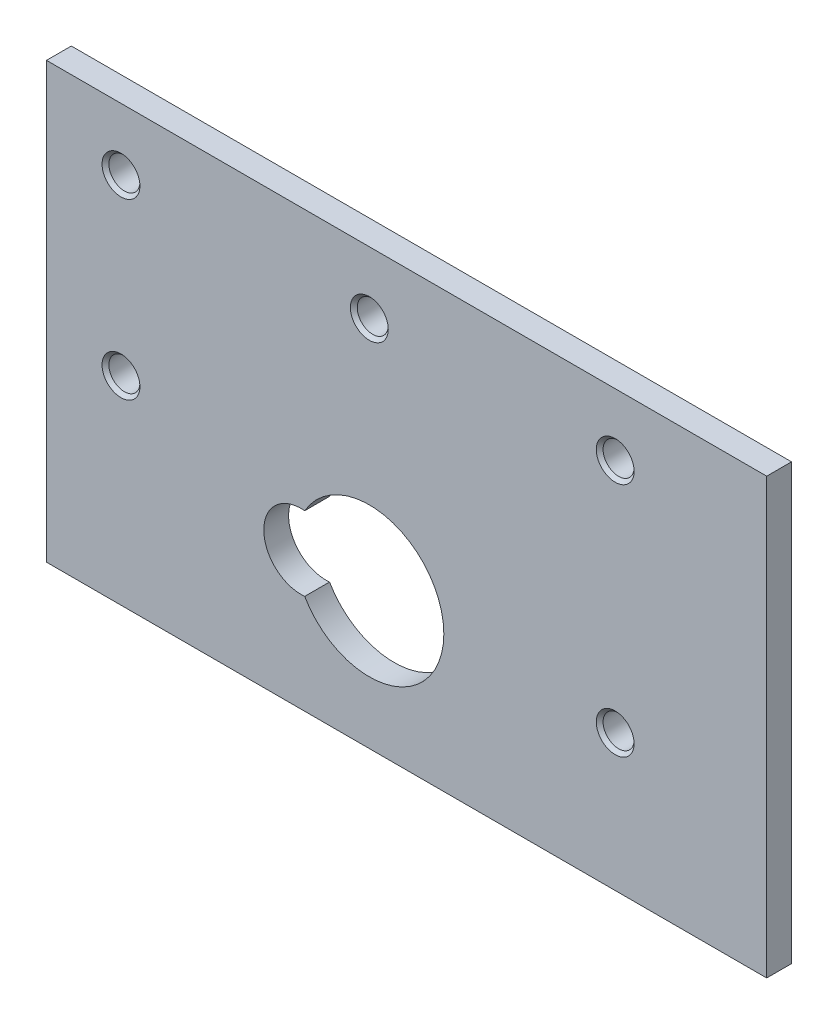
ISO-10303-21;
HEADER;
FILE_DESCRIPTION(('STEP AP214'),'2;1');
FILE_NAME('part.step','',(''),(''),'','','');
FILE_SCHEMA(('AUTOMOTIVE_DESIGN { 1 0 10303 214 1 1 1 1 }'));
ENDSEC;
DATA;
#1=APPLICATION_CONTEXT('core data for automotive mechanical design processes');
#2=APPLICATION_PROTOCOL_DEFINITION('international standard','automotive_design',2000,#1);
#3=PRODUCT_CONTEXT('',#1,'mechanical');
#4=PRODUCT('Part','Part','',(#3));
#5=PRODUCT_RELATED_PRODUCT_CATEGORY('part','',(#4));
#6=PRODUCT_DEFINITION_FORMATION('','',#4);
#7=PRODUCT_DEFINITION_CONTEXT('part definition',#1,'design');
#8=PRODUCT_DEFINITION('design','',#6,#7);
#9=PRODUCT_DEFINITION_SHAPE('','',#8);
#10=(LENGTH_UNIT() NAMED_UNIT(*) SI_UNIT(.MILLI.,.METRE.));
#11=(NAMED_UNIT(*) PLANE_ANGLE_UNIT() SI_UNIT($,.RADIAN.));
#12=(NAMED_UNIT(*) SI_UNIT($,.STERADIAN.) SOLID_ANGLE_UNIT());
#13=UNCERTAINTY_MEASURE_WITH_UNIT(LENGTH_MEASURE(1.E-05),#10,'distance_accuracy_value','');
#14=(GEOMETRIC_REPRESENTATION_CONTEXT(3) GLOBAL_UNCERTAINTY_ASSIGNED_CONTEXT((#13)) GLOBAL_UNIT_ASSIGNED_CONTEXT((#10,
#11,#12)) REPRESENTATION_CONTEXT('',''));
#15=CARTESIAN_POINT('',(0.,0.,0.));
#16=DIRECTION('',(0.,0.,1.));
#17=DIRECTION('',(1.,0.,0.));
#18=AXIS2_PLACEMENT_3D('',#15,#16,#17);
#19=CARTESIAN_POINT('',(29.,17.5,2.));
#20=DIRECTION('',(-1.,0.,0.));
#21=DIRECTION('',(0.,-1.,0.));
#22=AXIS2_PLACEMENT_3D('',#19,#20,#21);
#23=PLANE('',#22);
#24=DIRECTION('',(0.,1.,0.));
#25=VECTOR('',#24,1.);
#26=CARTESIAN_POINT('',(29.,17.5,0.));
#27=LINE('',#26,#25);
#28=CARTESIAN_POINT('',(29.,-17.5,0.));
#29=VERTEX_POINT('',#28);
#30=CARTESIAN_POINT('',(29.,17.5,0.));
#31=VERTEX_POINT('',#30);
#32=EDGE_CURVE('E189',#29,#31,#27,.T.);
#33=ORIENTED_EDGE('',*,*,#32,.T.);
#34=DIRECTION('',(0.,0.,-1.));
#35=VECTOR('',#34,1.);
#36=CARTESIAN_POINT('',(29.,17.5,2.));
#37=LINE('',#36,#35);
#38=CARTESIAN_POINT('',(29.,17.5,2.));
#39=VERTEX_POINT('',#38);
#40=EDGE_CURVE('E11',#39,#31,#37,.T.);
#41=ORIENTED_EDGE('',*,*,#40,.F.);
#42=DIRECTION('',(0.,1.,0.));
#43=VECTOR('',#42,1.);
#44=CARTESIAN_POINT('',(29.,17.5,2.));
#45=LINE('',#44,#43);
#46=CARTESIAN_POINT('',(29.,-17.5,2.));
#47=VERTEX_POINT('',#46);
#48=EDGE_CURVE('E190',#47,#39,#45,.T.);
#49=ORIENTED_EDGE('',*,*,#48,.F.);
#50=DIRECTION('',(0.,0.,-1.));
#51=VECTOR('',#50,1.);
#52=CARTESIAN_POINT('',(29.,-17.5,2.));
#53=LINE('',#52,#51);
#54=EDGE_CURVE('E204',#47,#29,#53,.T.);
#55=ORIENTED_EDGE('',*,*,#54,.T.);
#56=EDGE_LOOP('',(#33,#41,#49,#55));
#57=FACE_BOUND('',#56,.T.);
#58=ADVANCED_FACE('F53',(#57),#23,.F.);
#59=CARTESIAN_POINT('',(-29.,17.5,2.));
#60=DIRECTION('',(0.,-1.,0.));
#61=DIRECTION('',(0.,0.,-1.));
#62=AXIS2_PLACEMENT_3D('',#59,#60,#61);
#63=PLANE('',#62);
#64=DIRECTION('',(-1.,0.,0.));
#65=VECTOR('',#64,1.);
#66=CARTESIAN_POINT('',(-29.,17.5,0.));
#67=LINE('',#66,#65);
#68=CARTESIAN_POINT('',(-29.,17.5,0.));
#69=VERTEX_POINT('',#68);
#70=EDGE_CURVE('E208',#31,#69,#67,.T.);
#71=ORIENTED_EDGE('',*,*,#70,.T.);
#72=DIRECTION('',(0.,0.,-1.));
#73=VECTOR('',#72,1.);
#74=CARTESIAN_POINT('',(-29.,17.5,2.));
#75=LINE('',#74,#73);
#76=CARTESIAN_POINT('',(-29.,17.5,2.));
#77=VERTEX_POINT('',#76);
#78=EDGE_CURVE('E61',#77,#69,#75,.T.);
#79=ORIENTED_EDGE('',*,*,#78,.F.);
#80=DIRECTION('',(-1.,0.,0.));
#81=VECTOR('',#80,1.);
#82=CARTESIAN_POINT('',(-29.,17.5,2.));
#83=LINE('',#82,#81);
#84=EDGE_CURVE('E194',#39,#77,#83,.T.);
#85=ORIENTED_EDGE('',*,*,#84,.F.);
#86=ORIENTED_EDGE('',*,*,#40,.T.);
#87=EDGE_LOOP('',(#71,#79,#85,#86));
#88=FACE_BOUND('',#87,.T.);
#89=ADVANCED_FACE('F243',(#88),#63,.F.);
#90=CARTESIAN_POINT('',(-29.,17.5,2.));
#91=DIRECTION('',(1.,0.,0.));
#92=DIRECTION('',(0.,0.,-1.));
#93=AXIS2_PLACEMENT_3D('',#90,#91,#92);
#94=PLANE('',#93);
#95=DIRECTION('',(0.,-1.,0.));
#96=VECTOR('',#95,1.);
#97=CARTESIAN_POINT('',(-29.,17.5,0.));
#98=LINE('',#97,#96);
#99=CARTESIAN_POINT('',(-29.,-17.5,0.));
#100=VERTEX_POINT('',#99);
#101=EDGE_CURVE('E211',#69,#100,#98,.T.);
#102=ORIENTED_EDGE('',*,*,#101,.T.);
#103=DIRECTION('',(0.,0.,-1.));
#104=VECTOR('',#103,1.);
#105=CARTESIAN_POINT('',(-29.,-17.5,2.));
#106=LINE('',#105,#104);
#107=CARTESIAN_POINT('',(-29.,-17.5,2.));
#108=VERTEX_POINT('',#107);
#109=EDGE_CURVE('E219',#108,#100,#106,.T.);
#110=ORIENTED_EDGE('',*,*,#109,.F.);
#111=DIRECTION('',(0.,-1.,0.));
#112=VECTOR('',#111,1.);
#113=CARTESIAN_POINT('',(-29.,17.5,2.));
#114=LINE('',#113,#112);
#115=EDGE_CURVE('E198',#77,#108,#114,.T.);
#116=ORIENTED_EDGE('',*,*,#115,.F.);
#117=ORIENTED_EDGE('',*,*,#78,.T.);
#118=EDGE_LOOP('',(#102,#110,#116,#117));
#119=FACE_BOUND('',#118,.T.);
#120=ADVANCED_FACE('F228',(#119),#94,.F.);
#121=CARTESIAN_POINT('',(-29.,-17.5,2.));
#122=DIRECTION('',(0.,1.,0.));
#123=DIRECTION('',(0.,0.,1.));
#124=AXIS2_PLACEMENT_3D('',#121,#122,#123);
#125=PLANE('',#124);
#126=DIRECTION('',(1.,0.,0.));
#127=VECTOR('',#126,1.);
#128=CARTESIAN_POINT('',(-29.,-17.5,0.));
#129=LINE('',#128,#127);
#130=EDGE_CURVE('E195',#100,#29,#129,.T.);
#131=ORIENTED_EDGE('',*,*,#130,.T.);
#132=ORIENTED_EDGE('',*,*,#54,.F.);
#133=DIRECTION('',(1.,0.,0.));
#134=VECTOR('',#133,1.);
#135=CARTESIAN_POINT('',(-29.,-17.5,2.));
#136=LINE('',#135,#134);
#137=EDGE_CURVE('E201',#108,#47,#136,.T.);
#138=ORIENTED_EDGE('',*,*,#137,.F.);
#139=ORIENTED_EDGE('',*,*,#109,.T.);
#140=EDGE_LOOP('',(#131,#132,#138,#139));
#141=FACE_BOUND('',#140,.T.);
#142=ADVANCED_FACE('F236',(#141),#125,.F.);
#143=CARTESIAN_POINT('',(0.,0.,2.));
#144=DIRECTION('',(0.,0.,1.));
#145=DIRECTION('',(1.,0.,0.));
#146=AXIS2_PLACEMENT_3D('',#143,#144,#145);
#147=PLANE('',#146);
#148=CARTESIAN_POINT('',(-3.00000000000001,-6.50000000000001,2.));
#149=DIRECTION('',(0.,0.,1.));
#150=DIRECTION('',(1.,0.,0.));
#151=AXIS2_PLACEMENT_3D('',#148,#149,#150);
#152=CIRCLE('',#151,6.);
#153=CARTESIAN_POINT('',(-8.20454545454547,-9.48541565139099,2.));
#154=VERTEX_POINT('',#153);
#155=CARTESIAN_POINT('',(-8.20454545454547,-3.51458434860902,2.));
#156=VERTEX_POINT('',#155);
#157=EDGE_CURVE('E68',#154,#156,#152,.T.);
#158=ORIENTED_EDGE('',*,*,#157,.F.);
#159=CARTESIAN_POINT('',(-8.50000000000001,-6.50000000000001,2.));
#160=DIRECTION('',(0.,0.,1.));
#161=DIRECTION('',(1.,0.,0.));
#162=AXIS2_PLACEMENT_3D('',#159,#160,#161);
#163=CIRCLE('',#162,3.);
#164=EDGE_CURVE('E120',#156,#154,#163,.T.);
#165=ORIENTED_EDGE('',*,*,#164,.F.);
#166=EDGE_LOOP('',(#158,#165));
#167=FACE_BOUND('',#166,.T.);
#168=CARTESIAN_POINT('',(-23.,12.5,2.));
#169=DIRECTION('',(0.,0.,1.));
#170=DIRECTION('',(1.,0.,0.));
#171=AXIS2_PLACEMENT_3D('',#168,#169,#170);
#172=CIRCLE('',#171,1.525);
#173=CARTESIAN_POINT('',(-21.475,12.5,2.));
#174=VERTEX_POINT('',#173);
#175=EDGE_CURVE('E128',#174,#174,#172,.T.);
#176=ORIENTED_EDGE('',*,*,#175,.F.);
#177=EDGE_LOOP('',(#176));
#178=FACE_BOUND('',#177,.T.);
#179=CARTESIAN_POINT('',(-3.,12.5,2.));
#180=DIRECTION('',(0.,0.,1.));
#181=DIRECTION('',(1.,0.,0.));
#182=AXIS2_PLACEMENT_3D('',#179,#180,#181);
#183=CIRCLE('',#182,1.525);
#184=CARTESIAN_POINT('',(-1.475,12.5,2.));
#185=VERTEX_POINT('',#184);
#186=EDGE_CURVE('E141',#185,#185,#183,.T.);
#187=ORIENTED_EDGE('',*,*,#186,.F.);
#188=EDGE_LOOP('',(#187));
#189=FACE_BOUND('',#188,.T.);
#190=CARTESIAN_POINT('',(16.8,12.5,2.));
#191=DIRECTION('',(0.,0.,1.));
#192=DIRECTION('',(1.,0.,0.));
#193=AXIS2_PLACEMENT_3D('',#190,#191,#192);
#194=CIRCLE('',#193,1.525);
#195=CARTESIAN_POINT('',(18.325,12.5,2.));
#196=VERTEX_POINT('',#195);
#197=EDGE_CURVE('E153',#196,#196,#194,.T.);
#198=ORIENTED_EDGE('',*,*,#197,.F.);
#199=EDGE_LOOP('',(#198));
#200=FACE_BOUND('',#199,.T.);
#201=CARTESIAN_POINT('',(16.8,-6.50000000000001,2.));
#202=DIRECTION('',(0.,0.,1.));
#203=DIRECTION('',(1.,0.,0.));
#204=AXIS2_PLACEMENT_3D('',#201,#202,#203);
#205=CIRCLE('',#204,1.525);
#206=CARTESIAN_POINT('',(18.325,-6.50000000000001,2.));
#207=VERTEX_POINT('',#206);
#208=EDGE_CURVE('E165',#207,#207,#205,.T.);
#209=ORIENTED_EDGE('',*,*,#208,.F.);
#210=EDGE_LOOP('',(#209));
#211=FACE_BOUND('',#210,.T.);
#212=CARTESIAN_POINT('',(-23.,-1.5,2.));
#213=DIRECTION('',(0.,0.,1.));
#214=DIRECTION('',(1.,0.,0.));
#215=AXIS2_PLACEMENT_3D('',#212,#213,#214);
#216=CIRCLE('',#215,1.525);
#217=CARTESIAN_POINT('',(-21.475,-1.5,2.));
#218=VERTEX_POINT('',#217);
#219=EDGE_CURVE('E177',#218,#218,#216,.T.);
#220=ORIENTED_EDGE('',*,*,#219,.F.);
#221=EDGE_LOOP('',(#220));
#222=FACE_BOUND('',#221,.T.);
#223=ORIENTED_EDGE('',*,*,#48,.T.);
#224=ORIENTED_EDGE('',*,*,#84,.T.);
#225=ORIENTED_EDGE('',*,*,#115,.T.);
#226=ORIENTED_EDGE('',*,*,#137,.T.);
#227=EDGE_LOOP('',(#223,#224,#225,#226));
#228=FACE_BOUND('',#227,.T.);
#229=ADVANCED_FACE('F242',(#167,#178,#189,#200,#211,#222,#228),#147,.T.);
#230=CARTESIAN_POINT('',(0.,0.,0.));
#231=DIRECTION('',(0.,0.,1.));
#232=DIRECTION('',(1.,0.,0.));
#233=AXIS2_PLACEMENT_3D('',#230,#231,#232);
#234=PLANE('',#233);
#235=CARTESIAN_POINT('',(-8.50000000000001,-6.50000000000001,0.));
#236=DIRECTION('',(0.,0.,1.));
#237=DIRECTION('',(1.,0.,0.));
#238=AXIS2_PLACEMENT_3D('',#235,#236,#237);
#239=CIRCLE('',#238,3.);
#240=CARTESIAN_POINT('',(-8.20454545454547,-3.51458434860902,0.));
#241=VERTEX_POINT('',#240);
#242=CARTESIAN_POINT('',(-8.20454545454547,-9.48541565139099,0.));
#243=VERTEX_POINT('',#242);
#244=EDGE_CURVE('E110',#241,#243,#239,.T.);
#245=ORIENTED_EDGE('',*,*,#244,.T.);
#246=CARTESIAN_POINT('',(-3.00000000000001,-6.50000000000001,0.));
#247=DIRECTION('',(0.,0.,1.));
#248=DIRECTION('',(1.,0.,0.));
#249=AXIS2_PLACEMENT_3D('',#246,#247,#248);
#250=CIRCLE('',#249,6.);
#251=EDGE_CURVE('E73',#243,#241,#250,.T.);
#252=ORIENTED_EDGE('',*,*,#251,.T.);
#253=EDGE_LOOP('',(#245,#252));
#254=FACE_BOUND('',#253,.T.);
#255=CARTESIAN_POINT('',(-23.,12.5,0.));
#256=DIRECTION('',(0.,0.,1.));
#257=DIRECTION('',(1.,0.,0.));
#258=AXIS2_PLACEMENT_3D('',#255,#256,#257);
#259=CIRCLE('',#258,1.25);
#260=CARTESIAN_POINT('',(-21.75,12.5,0.));
#261=VERTEX_POINT('',#260);
#262=EDGE_CURVE('E137',#261,#261,#259,.T.);
#263=ORIENTED_EDGE('',*,*,#262,.T.);
#264=EDGE_LOOP('',(#263));
#265=FACE_BOUND('',#264,.T.);
#266=CARTESIAN_POINT('',(-3.,12.5,0.));
#267=DIRECTION('',(0.,0.,1.));
#268=DIRECTION('',(1.,0.,0.));
#269=AXIS2_PLACEMENT_3D('',#266,#267,#268);
#270=CIRCLE('',#269,1.25);
#271=CARTESIAN_POINT('',(-1.75,12.5,0.));
#272=VERTEX_POINT('',#271);
#273=EDGE_CURVE('E149',#272,#272,#270,.T.);
#274=ORIENTED_EDGE('',*,*,#273,.T.);
#275=EDGE_LOOP('',(#274));
#276=FACE_BOUND('',#275,.T.);
#277=CARTESIAN_POINT('',(16.8,12.5,0.));
#278=DIRECTION('',(0.,0.,1.));
#279=DIRECTION('',(1.,0.,0.));
#280=AXIS2_PLACEMENT_3D('',#277,#278,#279);
#281=CIRCLE('',#280,1.25);
#282=CARTESIAN_POINT('',(18.05,12.5,0.));
#283=VERTEX_POINT('',#282);
#284=EDGE_CURVE('E161',#283,#283,#281,.T.);
#285=ORIENTED_EDGE('',*,*,#284,.T.);
#286=EDGE_LOOP('',(#285));
#287=FACE_BOUND('',#286,.T.);
#288=CARTESIAN_POINT('',(16.8,-6.50000000000001,0.));
#289=DIRECTION('',(0.,0.,1.));
#290=DIRECTION('',(1.,0.,0.));
#291=AXIS2_PLACEMENT_3D('',#288,#289,#290);
#292=CIRCLE('',#291,1.25);
#293=CARTESIAN_POINT('',(18.05,-6.50000000000001,0.));
#294=VERTEX_POINT('',#293);
#295=EDGE_CURVE('E173',#294,#294,#292,.T.);
#296=ORIENTED_EDGE('',*,*,#295,.T.);
#297=EDGE_LOOP('',(#296));
#298=FACE_BOUND('',#297,.T.);
#299=CARTESIAN_POINT('',(-23.,-1.5,0.));
#300=DIRECTION('',(0.,0.,1.));
#301=DIRECTION('',(1.,0.,0.));
#302=AXIS2_PLACEMENT_3D('',#299,#300,#301);
#303=CIRCLE('',#302,1.25);
#304=CARTESIAN_POINT('',(-21.75,-1.5,0.));
#305=VERTEX_POINT('',#304);
#306=EDGE_CURVE('E185',#305,#305,#303,.T.);
#307=ORIENTED_EDGE('',*,*,#306,.T.);
#308=EDGE_LOOP('',(#307));
#309=FACE_BOUND('',#308,.T.);
#310=ORIENTED_EDGE('',*,*,#32,.F.);
#311=ORIENTED_EDGE('',*,*,#130,.F.);
#312=ORIENTED_EDGE('',*,*,#101,.F.);
#313=ORIENTED_EDGE('',*,*,#70,.F.);
#314=EDGE_LOOP('',(#310,#311,#312,#313));
#315=FACE_BOUND('',#314,.T.);
#316=ADVANCED_FACE('F117',(#254,#265,#276,#287,#298,#309,#315),#234,.F.);
#317=CARTESIAN_POINT('',(-23.,-1.5,2.));
#318=DIRECTION('',(0.,0.,1.));
#319=DIRECTION('',(1.,0.,0.));
#320=AXIS2_PLACEMENT_3D('',#317,#318,#319);
#321=CYLINDRICAL_SURFACE('',#320,1.24999999999999);
#322=ORIENTED_EDGE('',*,*,#306,.F.);
#323=EDGE_LOOP('',(#322));
#324=FACE_BOUND('',#323,.T.);
#325=CARTESIAN_POINT('',(-23.,-1.5,1.72499999999999));
#326=DIRECTION('',(0.,0.,1.));
#327=DIRECTION('',(1.,0.,0.));
#328=AXIS2_PLACEMENT_3D('',#325,#326,#327);
#329=CIRCLE('',#328,1.24999999999999);
#330=CARTESIAN_POINT('',(-21.75,-1.5,1.72499999999999));
#331=VERTEX_POINT('',#330);
#332=EDGE_CURVE('E181',#331,#331,#329,.T.);
#333=ORIENTED_EDGE('',*,*,#332,.T.);
#334=EDGE_LOOP('',(#333));
#335=FACE_BOUND('',#334,.T.);
#336=ADVANCED_FACE('F255',(#324,#335),#321,.F.);
#337=CARTESIAN_POINT('',(-23.,-1.5,2.));
#338=DIRECTION('',(0.,0.,1.));
#339=DIRECTION('',(1.,0.,0.));
#340=AXIS2_PLACEMENT_3D('',#337,#338,#339);
#341=CONICAL_SURFACE('',#340,1.525,0.785398163397451);
#342=ORIENTED_EDGE('',*,*,#332,.F.);
#343=EDGE_LOOP('',(#342));
#344=FACE_BOUND('',#343,.T.);
#345=ORIENTED_EDGE('',*,*,#219,.T.);
#346=EDGE_LOOP('',(#345));
#347=FACE_BOUND('',#346,.T.);
#348=ADVANCED_FACE('F261',(#344,#347),#341,.F.);
#349=CARTESIAN_POINT('',(16.8,-6.50000000000001,2.));
#350=DIRECTION('',(0.,0.,1.));
#351=DIRECTION('',(1.,0.,0.));
#352=AXIS2_PLACEMENT_3D('',#349,#350,#351);
#353=CYLINDRICAL_SURFACE('',#352,1.24999999999999);
#354=ORIENTED_EDGE('',*,*,#295,.F.);
#355=EDGE_LOOP('',(#354));
#356=FACE_BOUND('',#355,.T.);
#357=CARTESIAN_POINT('',(16.8,-6.50000000000001,1.72499999999999));
#358=DIRECTION('',(0.,0.,1.));
#359=DIRECTION('',(1.,0.,0.));
#360=AXIS2_PLACEMENT_3D('',#357,#358,#359);
#361=CIRCLE('',#360,1.24999999999999);
#362=CARTESIAN_POINT('',(18.05,-6.50000000000001,1.72499999999999));
#363=VERTEX_POINT('',#362);
#364=EDGE_CURVE('E169',#363,#363,#361,.T.);
#365=ORIENTED_EDGE('',*,*,#364,.T.);
#366=EDGE_LOOP('',(#365));
#367=FACE_BOUND('',#366,.T.);
#368=ADVANCED_FACE('F265',(#356,#367),#353,.F.);
#369=CARTESIAN_POINT('',(16.8,-6.50000000000001,2.));
#370=DIRECTION('',(0.,0.,1.));
#371=DIRECTION('',(1.,0.,0.));
#372=AXIS2_PLACEMENT_3D('',#369,#370,#371);
#373=CONICAL_SURFACE('',#372,1.525,0.785398163397451);
#374=ORIENTED_EDGE('',*,*,#364,.F.);
#375=EDGE_LOOP('',(#374));
#376=FACE_BOUND('',#375,.T.);
#377=ORIENTED_EDGE('',*,*,#208,.T.);
#378=EDGE_LOOP('',(#377));
#379=FACE_BOUND('',#378,.T.);
#380=ADVANCED_FACE('F269',(#376,#379),#373,.F.);
#381=CARTESIAN_POINT('',(16.8,12.5,2.));
#382=DIRECTION('',(0.,0.,1.));
#383=DIRECTION('',(1.,0.,0.));
#384=AXIS2_PLACEMENT_3D('',#381,#382,#383);
#385=CYLINDRICAL_SURFACE('',#384,1.24999999999999);
#386=ORIENTED_EDGE('',*,*,#284,.F.);
#387=EDGE_LOOP('',(#386));
#388=FACE_BOUND('',#387,.T.);
#389=CARTESIAN_POINT('',(16.8,12.5,1.72499999999999));
#390=DIRECTION('',(0.,0.,1.));
#391=DIRECTION('',(1.,0.,0.));
#392=AXIS2_PLACEMENT_3D('',#389,#390,#391);
#393=CIRCLE('',#392,1.24999999999999);
#394=CARTESIAN_POINT('',(18.05,12.5,1.72499999999999));
#395=VERTEX_POINT('',#394);
#396=EDGE_CURVE('E157',#395,#395,#393,.T.);
#397=ORIENTED_EDGE('',*,*,#396,.T.);
#398=EDGE_LOOP('',(#397));
#399=FACE_BOUND('',#398,.T.);
#400=ADVANCED_FACE('F273',(#388,#399),#385,.F.);
#401=CARTESIAN_POINT('',(16.8,12.5,2.));
#402=DIRECTION('',(0.,0.,1.));
#403=DIRECTION('',(1.,0.,0.));
#404=AXIS2_PLACEMENT_3D('',#401,#402,#403);
#405=CONICAL_SURFACE('',#404,1.525,0.785398163397451);
#406=ORIENTED_EDGE('',*,*,#396,.F.);
#407=EDGE_LOOP('',(#406));
#408=FACE_BOUND('',#407,.T.);
#409=ORIENTED_EDGE('',*,*,#197,.T.);
#410=EDGE_LOOP('',(#409));
#411=FACE_BOUND('',#410,.T.);
#412=ADVANCED_FACE('F277',(#408,#411),#405,.F.);
#413=CARTESIAN_POINT('',(-3.,12.5,2.));
#414=DIRECTION('',(0.,0.,1.));
#415=DIRECTION('',(1.,0.,0.));
#416=AXIS2_PLACEMENT_3D('',#413,#414,#415);
#417=CYLINDRICAL_SURFACE('',#416,1.24999999999999);
#418=ORIENTED_EDGE('',*,*,#273,.F.);
#419=EDGE_LOOP('',(#418));
#420=FACE_BOUND('',#419,.T.);
#421=CARTESIAN_POINT('',(-3.,12.5,1.72499999999999));
#422=DIRECTION('',(0.,0.,1.));
#423=DIRECTION('',(1.,0.,0.));
#424=AXIS2_PLACEMENT_3D('',#421,#422,#423);
#425=CIRCLE('',#424,1.24999999999999);
#426=CARTESIAN_POINT('',(-1.75000000000002,12.5,1.72499999999999));
#427=VERTEX_POINT('',#426);
#428=EDGE_CURVE('E145',#427,#427,#425,.T.);
#429=ORIENTED_EDGE('',*,*,#428,.T.);
#430=EDGE_LOOP('',(#429));
#431=FACE_BOUND('',#430,.T.);
#432=ADVANCED_FACE('F281',(#420,#431),#417,.F.);
#433=CARTESIAN_POINT('',(-3.,12.5,2.));
#434=DIRECTION('',(0.,0.,1.));
#435=DIRECTION('',(1.,0.,0.));
#436=AXIS2_PLACEMENT_3D('',#433,#434,#435);
#437=CONICAL_SURFACE('',#436,1.525,0.785398163397448);
#438=ORIENTED_EDGE('',*,*,#428,.F.);
#439=EDGE_LOOP('',(#438));
#440=FACE_BOUND('',#439,.T.);
#441=ORIENTED_EDGE('',*,*,#186,.T.);
#442=EDGE_LOOP('',(#441));
#443=FACE_BOUND('',#442,.T.);
#444=ADVANCED_FACE('F285',(#440,#443),#437,.F.);
#445=CARTESIAN_POINT('',(-23.,12.5,2.));
#446=DIRECTION('',(0.,0.,1.));
#447=DIRECTION('',(1.,0.,0.));
#448=AXIS2_PLACEMENT_3D('',#445,#446,#447);
#449=CYLINDRICAL_SURFACE('',#448,1.24999999999999);
#450=ORIENTED_EDGE('',*,*,#262,.F.);
#451=EDGE_LOOP('',(#450));
#452=FACE_BOUND('',#451,.T.);
#453=CARTESIAN_POINT('',(-23.,12.5,1.72499999999999));
#454=DIRECTION('',(0.,0.,1.));
#455=DIRECTION('',(1.,0.,0.));
#456=AXIS2_PLACEMENT_3D('',#453,#454,#455);
#457=CIRCLE('',#456,1.24999999999999);
#458=CARTESIAN_POINT('',(-21.75,12.5,1.72499999999999));
#459=VERTEX_POINT('',#458);
#460=EDGE_CURVE('E133',#459,#459,#457,.T.);
#461=ORIENTED_EDGE('',*,*,#460,.T.);
#462=EDGE_LOOP('',(#461));
#463=FACE_BOUND('',#462,.T.);
#464=ADVANCED_FACE('F289',(#452,#463),#449,.F.);
#465=CARTESIAN_POINT('',(-23.,12.5,2.));
#466=DIRECTION('',(0.,0.,1.));
#467=DIRECTION('',(1.,0.,0.));
#468=AXIS2_PLACEMENT_3D('',#465,#466,#467);
#469=CONICAL_SURFACE('',#468,1.525,0.785398163397451);
#470=ORIENTED_EDGE('',*,*,#460,.F.);
#471=EDGE_LOOP('',(#470));
#472=FACE_BOUND('',#471,.T.);
#473=ORIENTED_EDGE('',*,*,#175,.T.);
#474=EDGE_LOOP('',(#473));
#475=FACE_BOUND('',#474,.T.);
#476=ADVANCED_FACE('F293',(#472,#475),#469,.F.);
#477=CARTESIAN_POINT('',(-3.00000000000001,-6.50000000000001,0.));
#478=DIRECTION('',(0.,0.,1.));
#479=DIRECTION('',(1.,0.,0.));
#480=AXIS2_PLACEMENT_3D('',#477,#478,#479);
#481=CYLINDRICAL_SURFACE('',#480,6.);
#482=ORIENTED_EDGE('',*,*,#157,.T.);
#483=DIRECTION('',(0.,0.,1.));
#484=VECTOR('',#483,1.);
#485=CARTESIAN_POINT('',(-8.20454545454547,-3.51458434860902,0.));
#486=LINE('',#485,#484);
#487=EDGE_CURVE('E102',#241,#156,#486,.T.);
#488=ORIENTED_EDGE('',*,*,#487,.F.);
#489=ORIENTED_EDGE('',*,*,#251,.F.);
#490=DIRECTION('',(0.,0.,1.));
#491=VECTOR('',#490,1.);
#492=CARTESIAN_POINT('',(-8.20454545454547,-9.48541565139099,0.));
#493=LINE('',#492,#491);
#494=EDGE_CURVE('E109',#243,#154,#493,.T.);
#495=ORIENTED_EDGE('',*,*,#494,.T.);
#496=EDGE_LOOP('',(#482,#488,#489,#495));
#497=FACE_BOUND('',#496,.T.);
#498=ADVANCED_FACE('F104',(#497),#481,.F.);
#499=CARTESIAN_POINT('',(-8.50000000000001,-6.50000000000001,0.));
#500=DIRECTION('',(0.,0.,1.));
#501=DIRECTION('',(1.,0.,0.));
#502=AXIS2_PLACEMENT_3D('',#499,#500,#501);
#503=CYLINDRICAL_SURFACE('',#502,3.);
#504=ORIENTED_EDGE('',*,*,#164,.T.);
#505=ORIENTED_EDGE('',*,*,#494,.F.);
#506=ORIENTED_EDGE('',*,*,#244,.F.);
#507=ORIENTED_EDGE('',*,*,#487,.T.);
#508=EDGE_LOOP('',(#504,#505,#506,#507));
#509=FACE_BOUND('',#508,.T.);
#510=ADVANCED_FACE('F113',(#509),#503,.F.);
#511=CLOSED_SHELL('',(#58,#89,#120,#142,#229,#316,#336,#348,#368,#380,#400,#412,#432,#444,#464,
#476,#498,#510));
#512=MANIFOLD_SOLID_BREP('B2',#511);
#513=ADVANCED_BREP_SHAPE_REPRESENTATION('',(#18,#512),#14);
#514=SHAPE_DEFINITION_REPRESENTATION(#9,#513);
ENDSEC;
END-ISO-10303-21;
